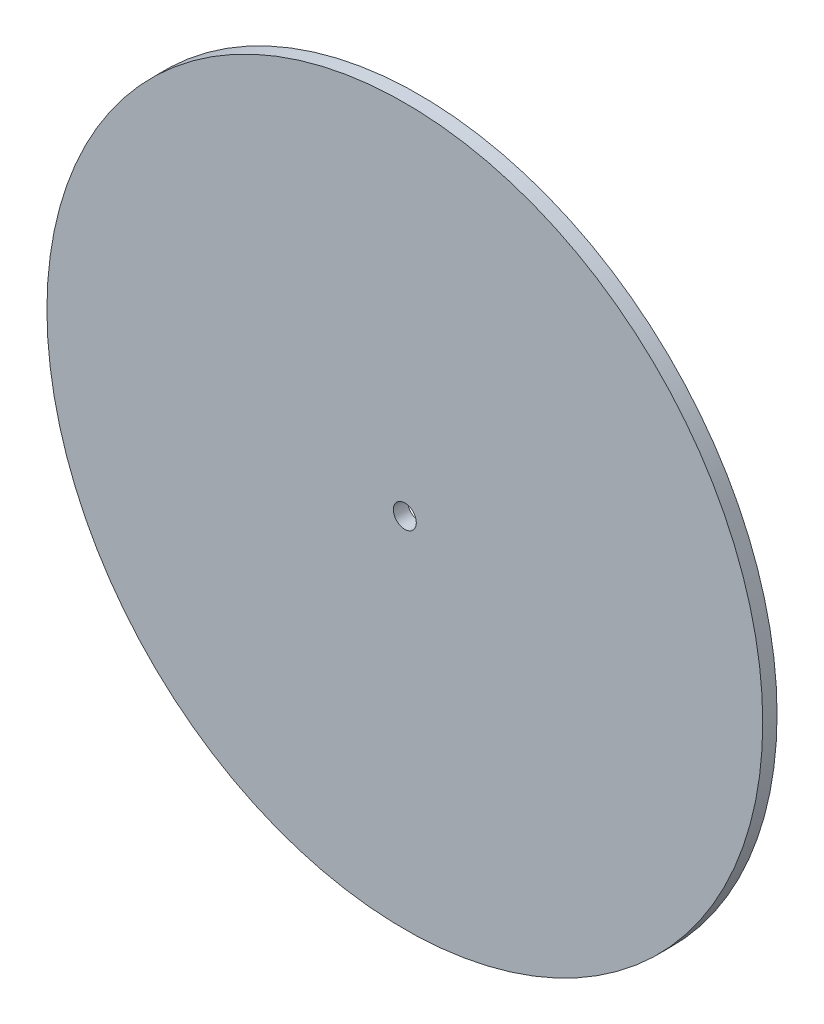
ISO-10303-21;
HEADER;
FILE_DESCRIPTION(('STEP AP214'),'2;1');
FILE_NAME('part.step','',(''),(''),'','','');
FILE_SCHEMA(('AUTOMOTIVE_DESIGN { 1 0 10303 214 1 1 1 1 }'));
ENDSEC;
DATA;
#1=APPLICATION_CONTEXT('core data for automotive mechanical design processes');
#2=APPLICATION_PROTOCOL_DEFINITION('international standard','automotive_design',2000,#1);
#3=PRODUCT_CONTEXT('',#1,'mechanical');
#4=PRODUCT('Part','Part','',(#3));
#5=PRODUCT_RELATED_PRODUCT_CATEGORY('part','',(#4));
#6=PRODUCT_DEFINITION_FORMATION('','',#4);
#7=PRODUCT_DEFINITION_CONTEXT('part definition',#1,'design');
#8=PRODUCT_DEFINITION('design','',#6,#7);
#9=PRODUCT_DEFINITION_SHAPE('','',#8);
#10=(LENGTH_UNIT() NAMED_UNIT(*) SI_UNIT(.MILLI.,.METRE.));
#11=(NAMED_UNIT(*) PLANE_ANGLE_UNIT() SI_UNIT($,.RADIAN.));
#12=(NAMED_UNIT(*) SI_UNIT($,.STERADIAN.) SOLID_ANGLE_UNIT());
#13=UNCERTAINTY_MEASURE_WITH_UNIT(LENGTH_MEASURE(1.E-05),#10,'distance_accuracy_value','');
#14=(GEOMETRIC_REPRESENTATION_CONTEXT(3) GLOBAL_UNCERTAINTY_ASSIGNED_CONTEXT((#13)) GLOBAL_UNIT_ASSIGNED_CONTEXT((#10,
#11,#12)) REPRESENTATION_CONTEXT('',''));
#15=CARTESIAN_POINT('',(0.,0.,0.));
#16=DIRECTION('',(0.,0.,1.));
#17=DIRECTION('',(1.,0.,0.));
#18=AXIS2_PLACEMENT_3D('',#15,#16,#17);
#19=CARTESIAN_POINT('',(0.,0.,2.5));
#20=DIRECTION('',(0.,0.,1.));
#21=DIRECTION('',(1.,0.,0.));
#22=AXIS2_PLACEMENT_3D('',#19,#20,#21);
#23=PLANE('',#22);
#24=CARTESIAN_POINT('',(0.,0.,2.5));
#25=DIRECTION('',(0.,0.,1.));
#26=DIRECTION('',(1.,0.,0.));
#27=AXIS2_PLACEMENT_3D('',#24,#25,#26);
#28=CIRCLE('',#27,62.5);
#29=CARTESIAN_POINT('',(62.5,0.,2.5));
#30=VERTEX_POINT('',#29);
#31=EDGE_CURVE('E10',#30,#30,#28,.T.);
#32=ORIENTED_EDGE('',*,*,#31,.T.);
#33=EDGE_LOOP('',(#32));
#34=FACE_BOUND('',#33,.T.);
#35=CARTESIAN_POINT('',(0.,0.,2.5));
#36=DIRECTION('',(0.,0.,1.));
#37=DIRECTION('',(1.,0.,0.));
#38=AXIS2_PLACEMENT_3D('',#35,#36,#37);
#39=CIRCLE('',#38,2.);
#40=CARTESIAN_POINT('',(2.,0.,2.5));
#41=VERTEX_POINT('',#40);
#42=EDGE_CURVE('E41',#41,#41,#39,.T.);
#43=ORIENTED_EDGE('',*,*,#42,.F.);
#44=EDGE_LOOP('',(#43));
#45=FACE_BOUND('',#44,.T.);
#46=ADVANCED_FACE('F30',(#34,#45),#23,.T.);
#47=CARTESIAN_POINT('',(0.,0.,0.));
#48=DIRECTION('',(0.,0.,1.));
#49=DIRECTION('',(1.,0.,0.));
#50=AXIS2_PLACEMENT_3D('',#47,#48,#49);
#51=PLANE('',#50);
#52=CARTESIAN_POINT('',(0.,0.,0.));
#53=DIRECTION('',(0.,0.,1.));
#54=DIRECTION('',(1.,0.,0.));
#55=AXIS2_PLACEMENT_3D('',#52,#53,#54);
#56=CIRCLE('',#55,62.5);
#57=CARTESIAN_POINT('',(62.5,0.,0.));
#58=VERTEX_POINT('',#57);
#59=EDGE_CURVE('E34',#58,#58,#56,.T.);
#60=ORIENTED_EDGE('',*,*,#59,.F.);
#61=EDGE_LOOP('',(#60));
#62=FACE_BOUND('',#61,.T.);
#63=CARTESIAN_POINT('',(0.,0.,0.));
#64=DIRECTION('',(0.,0.,1.));
#65=DIRECTION('',(1.,0.,0.));
#66=AXIS2_PLACEMENT_3D('',#63,#64,#65);
#67=CIRCLE('',#66,2.);
#68=CARTESIAN_POINT('',(2.,0.,0.));
#69=VERTEX_POINT('',#68);
#70=EDGE_CURVE('E43',#69,#69,#67,.T.);
#71=ORIENTED_EDGE('',*,*,#70,.T.);
#72=EDGE_LOOP('',(#71));
#73=FACE_BOUND('',#72,.T.);
#74=ADVANCED_FACE('F53',(#62,#73),#51,.F.);
#75=CARTESIAN_POINT('',(0.,0.,2.5));
#76=DIRECTION('',(0.,0.,-1.));
#77=DIRECTION('',(-1.,0.,0.));
#78=AXIS2_PLACEMENT_3D('',#75,#76,#77);
#79=CYLINDRICAL_SURFACE('',#78,62.5);
#80=ORIENTED_EDGE('',*,*,#31,.F.);
#81=EDGE_LOOP('',(#80));
#82=FACE_BOUND('',#81,.T.);
#83=ORIENTED_EDGE('',*,*,#59,.T.);
#84=EDGE_LOOP('',(#83));
#85=FACE_BOUND('',#84,.T.);
#86=ADVANCED_FACE('F32',(#82,#85),#79,.T.);
#87=CARTESIAN_POINT('',(0.,0.,2.5));
#88=DIRECTION('',(0.,0.,-1.));
#89=DIRECTION('',(-1.,0.,0.));
#90=AXIS2_PLACEMENT_3D('',#87,#88,#89);
#91=CYLINDRICAL_SURFACE('',#90,2.);
#92=ORIENTED_EDGE('',*,*,#42,.T.);
#93=EDGE_LOOP('',(#92));
#94=FACE_BOUND('',#93,.T.);
#95=ORIENTED_EDGE('',*,*,#70,.F.);
#96=EDGE_LOOP('',(#95));
#97=FACE_BOUND('',#96,.T.);
#98=ADVANCED_FACE('F49',(#94,#97),#91,.F.);
#99=CLOSED_SHELL('',(#46,#74,#86,#98));
#100=MANIFOLD_SOLID_BREP('B2',#99);
#101=ADVANCED_BREP_SHAPE_REPRESENTATION('',(#18,#100),#14);
#102=SHAPE_DEFINITION_REPRESENTATION(#9,#101);
ENDSEC;
END-ISO-10303-21;
